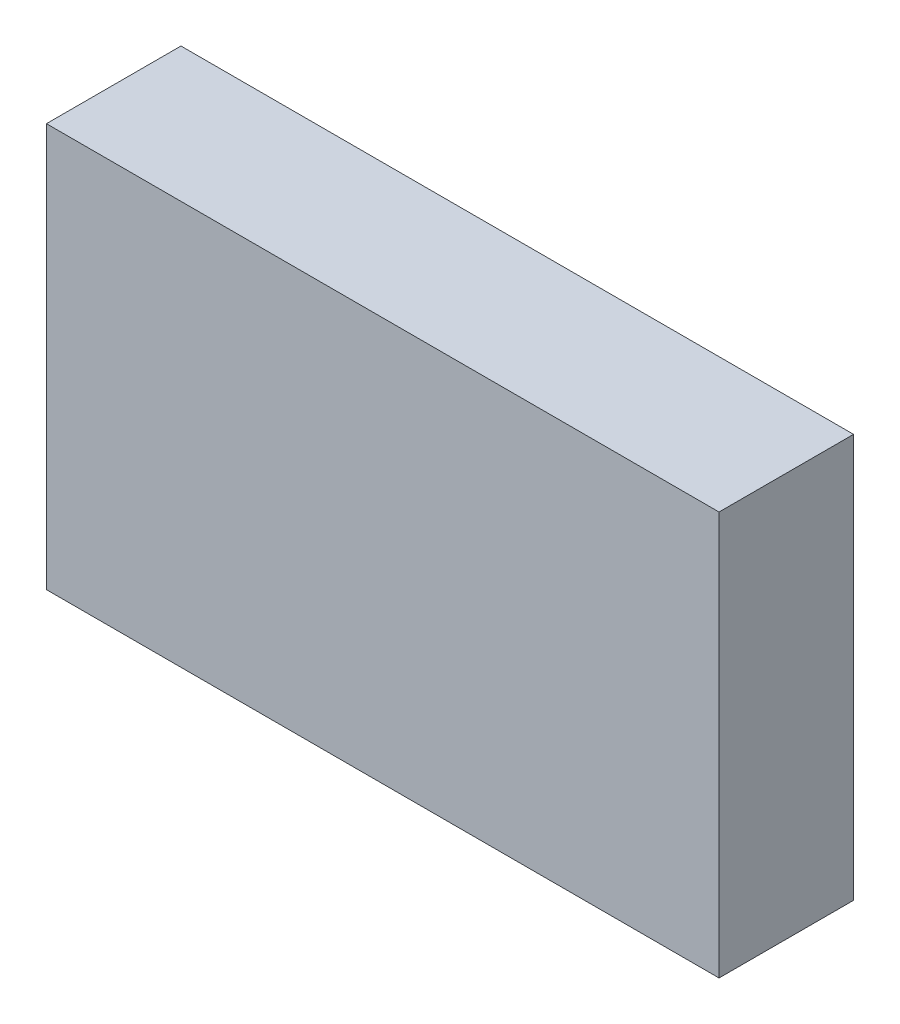
ISO-10303-21;
HEADER;
FILE_DESCRIPTION(('STEP AP214'),'2;1');
FILE_NAME('part.step','',(''),(''),'','','');
FILE_SCHEMA(('AUTOMOTIVE_DESIGN { 1 0 10303 214 1 1 1 1 }'));
ENDSEC;
DATA;
#1=APPLICATION_CONTEXT('core data for automotive mechanical design processes');
#2=APPLICATION_PROTOCOL_DEFINITION('international standard','automotive_design',2000,#1);
#3=PRODUCT_CONTEXT('',#1,'mechanical');
#4=PRODUCT('Part','Part','',(#3));
#5=PRODUCT_RELATED_PRODUCT_CATEGORY('part','',(#4));
#6=PRODUCT_DEFINITION_FORMATION('','',#4);
#7=PRODUCT_DEFINITION_CONTEXT('part definition',#1,'design');
#8=PRODUCT_DEFINITION('design','',#6,#7);
#9=PRODUCT_DEFINITION_SHAPE('','',#8);
#10=(LENGTH_UNIT() NAMED_UNIT(*) SI_UNIT(.MILLI.,.METRE.));
#11=(NAMED_UNIT(*) PLANE_ANGLE_UNIT() SI_UNIT($,.RADIAN.));
#12=(NAMED_UNIT(*) SI_UNIT($,.STERADIAN.) SOLID_ANGLE_UNIT());
#13=UNCERTAINTY_MEASURE_WITH_UNIT(LENGTH_MEASURE(1.E-05),#10,'distance_accuracy_value','');
#14=(GEOMETRIC_REPRESENTATION_CONTEXT(3) GLOBAL_UNCERTAINTY_ASSIGNED_CONTEXT((#13)) GLOBAL_UNIT_ASSIGNED_CONTEXT((#10,
#11,#12)) REPRESENTATION_CONTEXT('',''));
#15=CARTESIAN_POINT('',(0.,0.,0.));
#16=DIRECTION('',(0.,0.,1.));
#17=DIRECTION('',(1.,0.,0.));
#18=AXIS2_PLACEMENT_3D('',#15,#16,#17);
#19=CARTESIAN_POINT('',(0.,0.,2.));
#20=DIRECTION('',(1.,0.,0.));
#21=DIRECTION('',(0.,0.,-1.));
#22=AXIS2_PLACEMENT_3D('',#19,#20,#21);
#23=PLANE('',#22);
#24=DIRECTION('',(0.,-1.,0.));
#25=VECTOR('',#24,1.);
#26=CARTESIAN_POINT('',(0.,0.,0.));
#27=LINE('',#26,#25);
#28=CARTESIAN_POINT('',(0.,6.,0.));
#29=VERTEX_POINT('',#28);
#30=CARTESIAN_POINT('',(0.,0.,0.));
#31=VERTEX_POINT('',#30);
#32=EDGE_CURVE('E110',#29,#31,#27,.T.);
#33=ORIENTED_EDGE('',*,*,#32,.T.);
#34=DIRECTION('',(0.,0.,-1.));
#35=VECTOR('',#34,1.);
#36=CARTESIAN_POINT('',(0.,0.,2.));
#37=LINE('',#36,#35);
#38=CARTESIAN_POINT('',(0.,0.,2.));
#39=VERTEX_POINT('',#38);
#40=EDGE_CURVE('E11',#39,#31,#37,.T.);
#41=ORIENTED_EDGE('',*,*,#40,.F.);
#42=DIRECTION('',(0.,-1.,0.));
#43=VECTOR('',#42,1.);
#44=CARTESIAN_POINT('',(0.,0.,2.));
#45=LINE('',#44,#43);
#46=CARTESIAN_POINT('',(0.,6.,2.));
#47=VERTEX_POINT('',#46);
#48=EDGE_CURVE('E94',#47,#39,#45,.T.);
#49=ORIENTED_EDGE('',*,*,#48,.F.);
#50=DIRECTION('',(0.,0.,-1.));
#51=VECTOR('',#50,1.);
#52=CARTESIAN_POINT('',(0.,6.,2.));
#53=LINE('',#52,#51);
#54=EDGE_CURVE('E106',#47,#29,#53,.T.);
#55=ORIENTED_EDGE('',*,*,#54,.T.);
#56=EDGE_LOOP('',(#33,#41,#49,#55));
#57=FACE_BOUND('',#56,.T.);
#58=ADVANCED_FACE('F42',(#57),#23,.F.);
#59=CARTESIAN_POINT('',(0.,0.,2.));
#60=DIRECTION('',(0.,1.,0.));
#61=DIRECTION('',(0.,0.,1.));
#62=AXIS2_PLACEMENT_3D('',#59,#60,#61);
#63=PLANE('',#62);
#64=DIRECTION('',(1.,0.,0.));
#65=VECTOR('',#64,1.);
#66=CARTESIAN_POINT('',(0.,0.,0.));
#67=LINE('',#66,#65);
#68=CARTESIAN_POINT('',(10.,0.,0.));
#69=VERTEX_POINT('',#68);
#70=EDGE_CURVE('E99',#31,#69,#67,.T.);
#71=ORIENTED_EDGE('',*,*,#70,.T.);
#72=DIRECTION('',(0.,0.,-1.));
#73=VECTOR('',#72,1.);
#74=CARTESIAN_POINT('',(10.,0.,2.));
#75=LINE('',#74,#73);
#76=CARTESIAN_POINT('',(10.,0.,2.));
#77=VERTEX_POINT('',#76);
#78=EDGE_CURVE('E51',#77,#69,#75,.T.);
#79=ORIENTED_EDGE('',*,*,#78,.F.);
#80=DIRECTION('',(1.,0.,0.));
#81=VECTOR('',#80,1.);
#82=CARTESIAN_POINT('',(0.,0.,2.));
#83=LINE('',#82,#81);
#84=EDGE_CURVE('E89',#39,#77,#83,.T.);
#85=ORIENTED_EDGE('',*,*,#84,.F.);
#86=ORIENTED_EDGE('',*,*,#40,.T.);
#87=EDGE_LOOP('',(#71,#79,#85,#86));
#88=FACE_BOUND('',#87,.T.);
#89=ADVANCED_FACE('F98',(#88),#63,.F.);
#90=CARTESIAN_POINT('',(10.,0.,2.));
#91=DIRECTION('',(-1.,0.,0.));
#92=DIRECTION('',(0.,0.,1.));
#93=AXIS2_PLACEMENT_3D('',#90,#91,#92);
#94=PLANE('',#93);
#95=DIRECTION('',(0.,1.,0.));
#96=VECTOR('',#95,1.);
#97=CARTESIAN_POINT('',(10.,0.,0.));
#98=LINE('',#97,#96);
#99=CARTESIAN_POINT('',(10.,6.,0.));
#100=VERTEX_POINT('',#99);
#101=EDGE_CURVE('E76',#69,#100,#98,.T.);
#102=ORIENTED_EDGE('',*,*,#101,.T.);
#103=DIRECTION('',(0.,0.,-1.));
#104=VECTOR('',#103,1.);
#105=CARTESIAN_POINT('',(10.,6.,2.));
#106=LINE('',#105,#104);
#107=CARTESIAN_POINT('',(10.,6.,2.));
#108=VERTEX_POINT('',#107);
#109=EDGE_CURVE('E101',#108,#100,#106,.T.);
#110=ORIENTED_EDGE('',*,*,#109,.F.);
#111=DIRECTION('',(0.,1.,0.));
#112=VECTOR('',#111,1.);
#113=CARTESIAN_POINT('',(10.,0.,2.));
#114=LINE('',#113,#112);
#115=EDGE_CURVE('E92',#77,#108,#114,.T.);
#116=ORIENTED_EDGE('',*,*,#115,.F.);
#117=ORIENTED_EDGE('',*,*,#78,.T.);
#118=EDGE_LOOP('',(#102,#110,#116,#117));
#119=FACE_BOUND('',#118,.T.);
#120=ADVANCED_FACE('F102',(#119),#94,.F.);
#121=CARTESIAN_POINT('',(0.,6.,2.));
#122=DIRECTION('',(0.,-1.,0.));
#123=DIRECTION('',(0.,0.,-1.));
#124=AXIS2_PLACEMENT_3D('',#121,#122,#123);
#125=PLANE('',#124);
#126=DIRECTION('',(-1.,0.,0.));
#127=VECTOR('',#126,1.);
#128=CARTESIAN_POINT('',(0.,6.,0.));
#129=LINE('',#128,#127);
#130=EDGE_CURVE('E82',#100,#29,#129,.T.);
#131=ORIENTED_EDGE('',*,*,#130,.T.);
#132=ORIENTED_EDGE('',*,*,#54,.F.);
#133=DIRECTION('',(-1.,0.,0.));
#134=VECTOR('',#133,1.);
#135=CARTESIAN_POINT('',(0.,6.,2.));
#136=LINE('',#135,#134);
#137=EDGE_CURVE('E59',#108,#47,#136,.T.);
#138=ORIENTED_EDGE('',*,*,#137,.F.);
#139=ORIENTED_EDGE('',*,*,#109,.T.);
#140=EDGE_LOOP('',(#131,#132,#138,#139));
#141=FACE_BOUND('',#140,.T.);
#142=ADVANCED_FACE('F124',(#141),#125,.F.);
#143=CARTESIAN_POINT('',(0.,0.,2.));
#144=DIRECTION('',(0.,0.,-1.));
#145=DIRECTION('',(-1.,0.,0.));
#146=AXIS2_PLACEMENT_3D('',#143,#144,#145);
#147=PLANE('',#146);
#148=ORIENTED_EDGE('',*,*,#48,.T.);
#149=ORIENTED_EDGE('',*,*,#84,.T.);
#150=ORIENTED_EDGE('',*,*,#115,.T.);
#151=ORIENTED_EDGE('',*,*,#137,.T.);
#152=EDGE_LOOP('',(#148,#149,#150,#151));
#153=FACE_BOUND('',#152,.T.);
#154=ADVANCED_FACE('F90',(#153),#147,.F.);
#155=CARTESIAN_POINT('',(0.,0.,0.));
#156=DIRECTION('',(0.,0.,-1.));
#157=DIRECTION('',(-1.,0.,0.));
#158=AXIS2_PLACEMENT_3D('',#155,#156,#157);
#159=PLANE('',#158);
#160=CARTESIAN_POINT('',(5.,3.,0.));
#161=DIRECTION('',(0.,0.,-1.));
#162=DIRECTION('',(-1.,0.,0.));
#163=AXIS2_PLACEMENT_3D('',#160,#161,#162);
#164=CIRCLE('',#163,2.5);
#165=CARTESIAN_POINT('',(2.5,3.,0.));
#166=VERTEX_POINT('',#165);
#167=EDGE_CURVE('E131',#166,#166,#164,.T.);
#168=ORIENTED_EDGE('',*,*,#167,.F.);
#169=EDGE_LOOP('',(#168));
#170=FACE_BOUND('',#169,.T.);
#171=ORIENTED_EDGE('',*,*,#32,.F.);
#172=ORIENTED_EDGE('',*,*,#130,.F.);
#173=ORIENTED_EDGE('',*,*,#101,.F.);
#174=ORIENTED_EDGE('',*,*,#70,.F.);
#175=EDGE_LOOP('',(#171,#172,#173,#174));
#176=FACE_BOUND('',#175,.T.);
#177=ADVANCED_FACE('F127',(#170,#176),#159,.T.);
#178=CARTESIAN_POINT('',(5.,3.,1.));
#179=DIRECTION('',(0.,0.,-1.));
#180=DIRECTION('',(-1.,0.,0.));
#181=AXIS2_PLACEMENT_3D('',#178,#179,#180);
#182=CYLINDRICAL_SURFACE('',#181,2.5);
#183=CARTESIAN_POINT('',(5.,3.,1.));
#184=DIRECTION('',(0.,0.,-1.));
#185=DIRECTION('',(-1.,0.,0.));
#186=AXIS2_PLACEMENT_3D('',#183,#184,#185);
#187=CIRCLE('',#186,2.5);
#188=CARTESIAN_POINT('',(2.5,3.,1.));
#189=VERTEX_POINT('',#188);
#190=EDGE_CURVE('E114',#189,#189,#187,.T.);
#191=ORIENTED_EDGE('',*,*,#190,.F.);
#192=EDGE_LOOP('',(#191));
#193=FACE_BOUND('',#192,.T.);
#194=ORIENTED_EDGE('',*,*,#167,.T.);
#195=EDGE_LOOP('',(#194));
#196=FACE_BOUND('',#195,.T.);
#197=ADVANCED_FACE('F141',(#193,#196),#182,.F.);
#198=CARTESIAN_POINT('',(5.,3.,1.));
#199=DIRECTION('',(0.,0.,-1.));
#200=DIRECTION('',(-1.,0.,0.));
#201=AXIS2_PLACEMENT_3D('',#198,#199,#200);
#202=PLANE('',#201);
#203=ORIENTED_EDGE('',*,*,#190,.T.);
#204=EDGE_LOOP('',(#203));
#205=FACE_BOUND('',#204,.T.);
#206=ADVANCED_FACE('F139',(#205),#202,.T.);
#207=CLOSED_SHELL('',(#58,#89,#120,#142,#154,#177,#197,#206));
#208=MANIFOLD_SOLID_BREP('B2',#207);
#209=ADVANCED_BREP_SHAPE_REPRESENTATION('',(#18,#208),#14);
#210=SHAPE_DEFINITION_REPRESENTATION(#9,#209);
ENDSEC;
END-ISO-10303-21;
